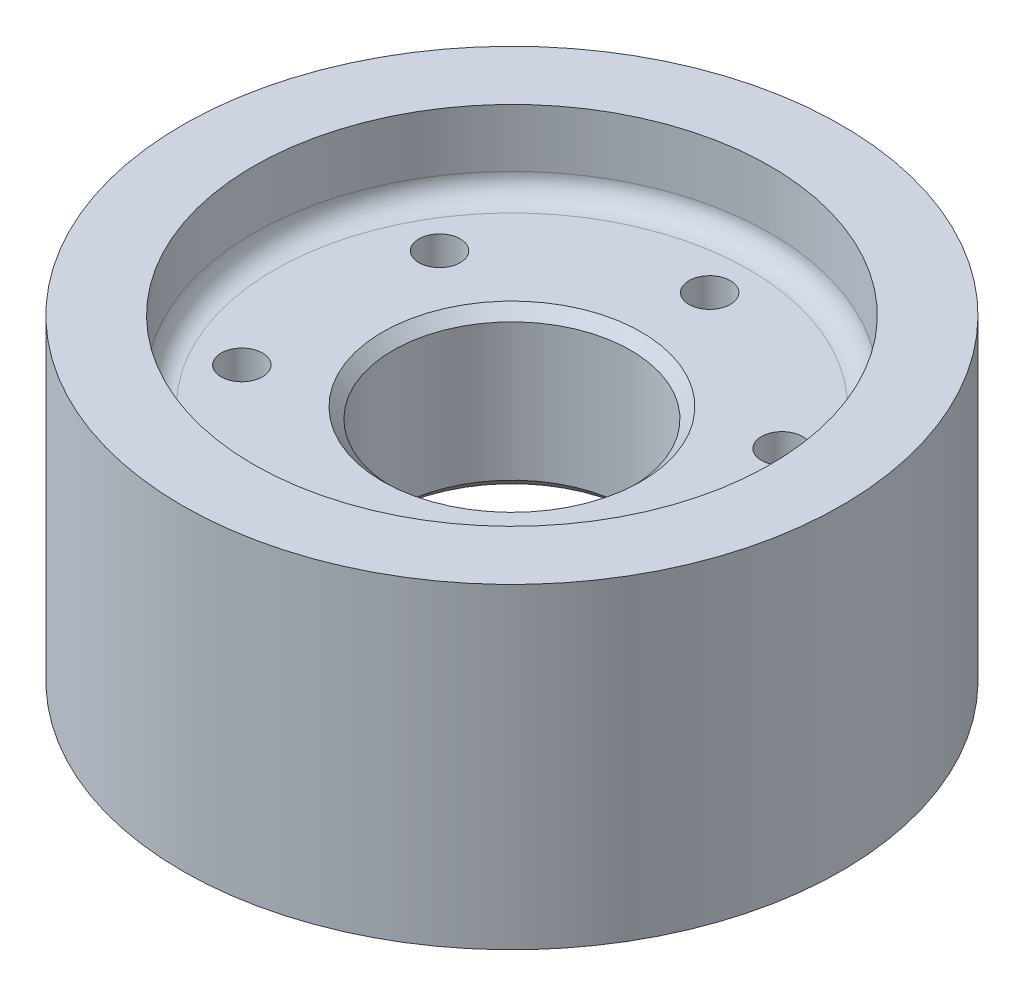
ISO-10303-21;
HEADER;
FILE_DESCRIPTION(('STEP AP214'),'2;1');
FILE_NAME('part.step','',(''),(''),'','','');
FILE_SCHEMA(('AUTOMOTIVE_DESIGN { 1 0 10303 214 1 1 1 1 }'));
ENDSEC;
DATA;
#1=APPLICATION_CONTEXT('core data for automotive mechanical design processes');
#2=APPLICATION_PROTOCOL_DEFINITION('international standard','automotive_design',2000,#1);
#3=PRODUCT_CONTEXT('',#1,'mechanical');
#4=PRODUCT('Part','Part','',(#3));
#5=PRODUCT_RELATED_PRODUCT_CATEGORY('part','',(#4));
#6=PRODUCT_DEFINITION_FORMATION('','',#4);
#7=PRODUCT_DEFINITION_CONTEXT('part definition',#1,'design');
#8=PRODUCT_DEFINITION('design','',#6,#7);
#9=PRODUCT_DEFINITION_SHAPE('','',#8);
#10=(LENGTH_UNIT() NAMED_UNIT(*) SI_UNIT(.MILLI.,.METRE.));
#11=(NAMED_UNIT(*) PLANE_ANGLE_UNIT() SI_UNIT($,.RADIAN.));
#12=(NAMED_UNIT(*) SI_UNIT($,.STERADIAN.) SOLID_ANGLE_UNIT());
#13=UNCERTAINTY_MEASURE_WITH_UNIT(LENGTH_MEASURE(1.E-05),#10,'distance_accuracy_value','');
#14=(GEOMETRIC_REPRESENTATION_CONTEXT(3) GLOBAL_UNCERTAINTY_ASSIGNED_CONTEXT((#13)) GLOBAL_UNIT_ASSIGNED_CONTEXT((#10,
#11,#12)) REPRESENTATION_CONTEXT('',''));
#15=CARTESIAN_POINT('',(0.,0.,0.));
#16=DIRECTION('',(0.,0.,1.));
#17=DIRECTION('',(1.,0.,0.));
#18=AXIS2_PLACEMENT_3D('',#15,#16,#17);
#19=CARTESIAN_POINT('',(0.,19.05,0.));
#20=DIRECTION('',(0.,-1.,0.));
#21=DIRECTION('',(0.,0.,-1.));
#22=AXIS2_PLACEMENT_3D('',#19,#20,#21);
#23=CYLINDRICAL_SURFACE('',#22,31.115);
#24=CARTESIAN_POINT('',(0.,-12.065,0.));
#25=DIRECTION('',(0.,1.,0.));
#26=DIRECTION('',(0.,0.,1.));
#27=AXIS2_PLACEMENT_3D('',#24,#25,#26);
#28=CIRCLE('',#27,31.115);
#29=CARTESIAN_POINT('',(0.,-12.065,31.115));
#30=VERTEX_POINT('',#29);
#31=EDGE_CURVE('E10',#30,#30,#28,.T.);
#32=ORIENTED_EDGE('',*,*,#31,.T.);
#33=EDGE_LOOP('',(#32));
#34=FACE_BOUND('',#33,.T.);
#35=CARTESIAN_POINT('',(0.,-19.05,0.));
#36=DIRECTION('',(0.,1.,0.));
#37=DIRECTION('',(0.,0.,1.));
#38=AXIS2_PLACEMENT_3D('',#35,#36,#37);
#39=CIRCLE('',#38,31.115);
#40=CARTESIAN_POINT('',(0.,-19.05,31.115));
#41=VERTEX_POINT('',#40);
#42=EDGE_CURVE('E83',#41,#41,#39,.T.);
#43=ORIENTED_EDGE('',*,*,#42,.F.);
#44=EDGE_LOOP('',(#43));
#45=FACE_BOUND('',#44,.T.);
#46=ADVANCED_FACE('F34',(#34,#45),#23,.F.);
#47=CARTESIAN_POINT('',(0.,19.05,0.));
#48=DIRECTION('',(0.,1.,0.));
#49=DIRECTION('',(0.,0.,1.));
#50=AXIS2_PLACEMENT_3D('',#47,#48,#49);
#51=PLANE('',#50);
#52=CARTESIAN_POINT('',(0.,19.05,0.));
#53=DIRECTION('',(0.,1.,0.));
#54=DIRECTION('',(0.,0.,1.));
#55=AXIS2_PLACEMENT_3D('',#52,#53,#54);
#56=CIRCLE('',#55,39.6875);
#57=CARTESIAN_POINT('',(0.,19.05,39.6875));
#58=VERTEX_POINT('',#57);
#59=EDGE_CURVE('E66',#58,#58,#56,.T.);
#60=ORIENTED_EDGE('',*,*,#59,.T.);
#61=EDGE_LOOP('',(#60));
#62=FACE_BOUND('',#61,.T.);
#63=CARTESIAN_POINT('',(0.,19.05,0.));
#64=DIRECTION('',(0.,1.,0.));
#65=DIRECTION('',(0.,0.,1.));
#66=AXIS2_PLACEMENT_3D('',#63,#64,#65);
#67=CIRCLE('',#66,31.115);
#68=CARTESIAN_POINT('',(0.,19.05,31.115));
#69=VERTEX_POINT('',#68);
#70=EDGE_CURVE('E80',#69,#69,#67,.T.);
#71=ORIENTED_EDGE('',*,*,#70,.F.);
#72=EDGE_LOOP('',(#71));
#73=FACE_BOUND('',#72,.T.);
#74=ADVANCED_FACE('F153',(#62,#73),#51,.T.);
#75=CARTESIAN_POINT('',(0.,-19.05,0.));
#76=DIRECTION('',(0.,1.,0.));
#77=DIRECTION('',(0.,0.,1.));
#78=AXIS2_PLACEMENT_3D('',#75,#76,#77);
#79=PLANE('',#78);
#80=CARTESIAN_POINT('',(0.,-19.05,0.));
#81=DIRECTION('',(0.,1.,0.));
#82=DIRECTION('',(0.,0.,1.));
#83=AXIS2_PLACEMENT_3D('',#80,#81,#82);
#84=CIRCLE('',#83,39.6875);
#85=CARTESIAN_POINT('',(0.,-19.05,39.6875));
#86=VERTEX_POINT('',#85);
#87=EDGE_CURVE('E77',#86,#86,#84,.T.);
#88=ORIENTED_EDGE('',*,*,#87,.F.);
#89=EDGE_LOOP('',(#88));
#90=FACE_BOUND('',#89,.T.);
#91=ORIENTED_EDGE('',*,*,#42,.T.);
#92=EDGE_LOOP('',(#91));
#93=FACE_BOUND('',#92,.T.);
#94=ADVANCED_FACE('F158',(#90,#93),#79,.F.);
#95=CARTESIAN_POINT('',(0.,19.05,0.));
#96=DIRECTION('',(0.,-1.,0.));
#97=DIRECTION('',(0.,0.,-1.));
#98=AXIS2_PLACEMENT_3D('',#95,#96,#97);
#99=CYLINDRICAL_SURFACE('',#98,39.6875);
#100=ORIENTED_EDGE('',*,*,#59,.F.);
#101=EDGE_LOOP('',(#100));
#102=FACE_BOUND('',#101,.T.);
#103=ORIENTED_EDGE('',*,*,#87,.T.);
#104=EDGE_LOOP('',(#103));
#105=FACE_BOUND('',#104,.T.);
#106=ADVANCED_FACE('F163',(#102,#105),#99,.T.);
#107=CARTESIAN_POINT('',(0.,12.065,0.));
#108=DIRECTION('',(0.,1.,0.));
#109=DIRECTION('',(0.,0.,1.));
#110=AXIS2_PLACEMENT_3D('',#107,#108,#109);
#111=CIRCLE('',#110,31.115);
#112=CARTESIAN_POINT('',(0.,12.065,31.115));
#113=VERTEX_POINT('',#112);
#114=EDGE_CURVE('E49',#113,#113,#111,.F.);
#115=ORIENTED_EDGE('',*,*,#114,.T.);
#116=EDGE_LOOP('',(#115));
#117=FACE_BOUND('',#116,.T.);
#118=ORIENTED_EDGE('',*,*,#70,.T.);
#119=EDGE_LOOP('',(#118));
#120=FACE_BOUND('',#119,.T.);
#121=ADVANCED_FACE('F122',(#117,#120),#23,.F.);
#122=CARTESIAN_POINT('',(0.,9.525,0.));
#123=DIRECTION('',(0.,1.,0.));
#124=DIRECTION('',(0.,0.,1.));
#125=AXIS2_PLACEMENT_3D('',#122,#123,#124);
#126=PLANE('',#125);
#127=CARTESIAN_POINT('',(0.,9.525,0.));
#128=DIRECTION('',(0.,1.,0.));
#129=DIRECTION('',(0.,0.,1.));
#130=AXIS2_PLACEMENT_3D('',#127,#128,#129);
#131=CIRCLE('',#130,28.575);
#132=CARTESIAN_POINT('',(0.,9.525,28.575));
#133=VERTEX_POINT('',#132);
#134=EDGE_CURVE('E45',#133,#133,#131,.T.);
#135=ORIENTED_EDGE('',*,*,#134,.T.);
#136=EDGE_LOOP('',(#135));
#137=FACE_BOUND('',#136,.T.);
#138=CARTESIAN_POINT('',(0.,9.525,0.));
#139=DIRECTION('',(0.,1.,0.));
#140=DIRECTION('',(0.,0.,1.));
#141=AXIS2_PLACEMENT_3D('',#138,#139,#140);
#142=CIRCLE('',#141,15.5829000000001);
#143=CARTESIAN_POINT('',(0.,9.525,15.5829000000001));
#144=VERTEX_POINT('',#143);
#145=EDGE_CURVE('E57',#144,#144,#142,.F.);
#146=ORIENTED_EDGE('',*,*,#145,.T.);
#147=EDGE_LOOP('',(#146));
#148=FACE_BOUND('',#147,.T.);
#149=CARTESIAN_POINT('',(20.6222299276168,9.525,-11.9062500000002));
#150=DIRECTION('',(0.,1.,0.));
#151=DIRECTION('',(0.,0.,1.));
#152=AXIS2_PLACEMENT_3D('',#149,#150,#151);
#153=CIRCLE('',#152,2.4892);
#154=CARTESIAN_POINT('',(20.6222299276168,9.525,-9.41705000000024));
#155=VERTEX_POINT('',#154);
#156=EDGE_CURVE('E71',#155,#155,#153,.T.);
#157=ORIENTED_EDGE('',*,*,#156,.F.);
#158=EDGE_LOOP('',(#157));
#159=FACE_BOUND('',#158,.T.);
#160=CARTESIAN_POINT('',(20.6222299276171,9.525,11.9062499999998));
#161=DIRECTION('',(0.,1.,0.));
#162=DIRECTION('',(0.,0.,1.));
#163=AXIS2_PLACEMENT_3D('',#160,#161,#162);
#164=CIRCLE('',#163,2.4892);
#165=CARTESIAN_POINT('',(20.6222299276171,9.525,14.3954499999998));
#166=VERTEX_POINT('',#165);
#167=EDGE_CURVE('E70',#166,#166,#164,.T.);
#168=ORIENTED_EDGE('',*,*,#167,.F.);
#169=EDGE_LOOP('',(#168));
#170=FACE_BOUND('',#169,.T.);
#171=CARTESIAN_POINT('',(0.,9.525,23.8125));
#172=DIRECTION('',(0.,1.,0.));
#173=DIRECTION('',(0.,0.,1.));
#174=AXIS2_PLACEMENT_3D('',#171,#172,#173);
#175=CIRCLE('',#174,2.4892);
#176=CARTESIAN_POINT('',(0.,9.525,26.3017));
#177=VERTEX_POINT('',#176);
#178=EDGE_CURVE('E104',#177,#177,#175,.T.);
#179=ORIENTED_EDGE('',*,*,#178,.F.);
#180=EDGE_LOOP('',(#179));
#181=FACE_BOUND('',#180,.T.);
#182=CARTESIAN_POINT('',(-20.6222299276169,9.525,11.9062500000001));
#183=DIRECTION('',(0.,1.,0.));
#184=DIRECTION('',(0.,0.,1.));
#185=AXIS2_PLACEMENT_3D('',#182,#183,#184);
#186=CIRCLE('',#185,2.4892);
#187=CARTESIAN_POINT('',(-20.6222299276169,9.525,14.3954500000001));
#188=VERTEX_POINT('',#187);
#189=EDGE_CURVE('E98',#188,#188,#186,.T.);
#190=ORIENTED_EDGE('',*,*,#189,.F.);
#191=EDGE_LOOP('',(#190));
#192=FACE_BOUND('',#191,.T.);
#193=CARTESIAN_POINT('',(-20.622229927617,9.525,-11.90625));
#194=DIRECTION('',(0.,1.,0.));
#195=DIRECTION('',(0.,0.,1.));
#196=AXIS2_PLACEMENT_3D('',#193,#194,#195);
#197=CIRCLE('',#196,2.4892);
#198=CARTESIAN_POINT('',(-20.622229927617,9.525,-9.41704999999996));
#199=VERTEX_POINT('',#198);
#200=EDGE_CURVE('E76',#199,#199,#197,.T.);
#201=ORIENTED_EDGE('',*,*,#200,.F.);
#202=EDGE_LOOP('',(#201));
#203=FACE_BOUND('',#202,.T.);
#204=CARTESIAN_POINT('',(0.,9.525,-23.8125));
#205=DIRECTION('',(0.,1.,0.));
#206=DIRECTION('',(0.,0.,1.));
#207=AXIS2_PLACEMENT_3D('',#204,#205,#206);
#208=CIRCLE('',#207,2.4892);
#209=CARTESIAN_POINT('',(0.,9.525,-21.3233));
#210=VERTEX_POINT('',#209);
#211=EDGE_CURVE('E75',#210,#210,#208,.T.);
#212=ORIENTED_EDGE('',*,*,#211,.F.);
#213=EDGE_LOOP('',(#212));
#214=FACE_BOUND('',#213,.T.);
#215=ADVANCED_FACE('F118',(#137,#148,#159,#170,#181,#192,#203,#214),#126,.T.);
#216=CARTESIAN_POINT('',(0.,-9.525,0.));
#217=DIRECTION('',(0.,1.,0.));
#218=DIRECTION('',(0.,0.,1.));
#219=AXIS2_PLACEMENT_3D('',#216,#217,#218);
#220=PLANE('',#219);
#221=CARTESIAN_POINT('',(0.,-9.525,0.));
#222=DIRECTION('',(0.,1.,0.));
#223=DIRECTION('',(0.,0.,1.));
#224=AXIS2_PLACEMENT_3D('',#221,#222,#223);
#225=CIRCLE('',#224,28.575);
#226=CARTESIAN_POINT('',(0.,-9.525,28.575));
#227=VERTEX_POINT('',#226);
#228=EDGE_CURVE('E41',#227,#227,#225,.F.);
#229=ORIENTED_EDGE('',*,*,#228,.T.);
#230=EDGE_LOOP('',(#229));
#231=FACE_BOUND('',#230,.T.);
#232=CARTESIAN_POINT('',(0.,-9.525,0.));
#233=DIRECTION('',(0.,1.,0.));
#234=DIRECTION('',(0.,0.,1.));
#235=AXIS2_PLACEMENT_3D('',#232,#233,#234);
#236=CIRCLE('',#235,15.5829);
#237=CARTESIAN_POINT('',(0.,-9.525,15.5829));
#238=VERTEX_POINT('',#237);
#239=EDGE_CURVE('E54',#238,#238,#236,.T.);
#240=ORIENTED_EDGE('',*,*,#239,.T.);
#241=EDGE_LOOP('',(#240));
#242=FACE_BOUND('',#241,.T.);
#243=CARTESIAN_POINT('',(20.6222299276168,-9.525,-11.9062500000002));
#244=DIRECTION('',(0.,1.,0.));
#245=DIRECTION('',(0.,0.,1.));
#246=AXIS2_PLACEMENT_3D('',#243,#244,#245);
#247=CIRCLE('',#246,2.4892);
#248=CARTESIAN_POINT('',(20.6222299276168,-9.525,-9.41705000000025));
#249=VERTEX_POINT('',#248);
#250=EDGE_CURVE('E67',#249,#249,#247,.T.);
#251=ORIENTED_EDGE('',*,*,#250,.T.);
#252=EDGE_LOOP('',(#251));
#253=FACE_BOUND('',#252,.T.);
#254=CARTESIAN_POINT('',(20.6222299276171,-9.525,11.9062499999998));
#255=DIRECTION('',(0.,1.,0.));
#256=DIRECTION('',(0.,0.,1.));
#257=AXIS2_PLACEMENT_3D('',#254,#255,#256);
#258=CIRCLE('',#257,2.4892);
#259=CARTESIAN_POINT('',(20.6222299276171,-9.525,14.3954499999998));
#260=VERTEX_POINT('',#259);
#261=EDGE_CURVE('E107',#260,#260,#258,.T.);
#262=ORIENTED_EDGE('',*,*,#261,.T.);
#263=EDGE_LOOP('',(#262));
#264=FACE_BOUND('',#263,.T.);
#265=CARTESIAN_POINT('',(0.,-9.525,23.8125));
#266=DIRECTION('',(0.,1.,0.));
#267=DIRECTION('',(0.,0.,1.));
#268=AXIS2_PLACEMENT_3D('',#265,#266,#267);
#269=CIRCLE('',#268,2.4892);
#270=CARTESIAN_POINT('',(0.,-9.525,26.3017));
#271=VERTEX_POINT('',#270);
#272=EDGE_CURVE('E101',#271,#271,#269,.T.);
#273=ORIENTED_EDGE('',*,*,#272,.T.);
#274=EDGE_LOOP('',(#273));
#275=FACE_BOUND('',#274,.T.);
#276=CARTESIAN_POINT('',(-20.6222299276169,-9.525,11.9062500000001));
#277=DIRECTION('',(0.,1.,0.));
#278=DIRECTION('',(0.,0.,1.));
#279=AXIS2_PLACEMENT_3D('',#276,#277,#278);
#280=CIRCLE('',#279,2.4892);
#281=CARTESIAN_POINT('',(-20.6222299276169,-9.525,14.3954500000001));
#282=VERTEX_POINT('',#281);
#283=EDGE_CURVE('E95',#282,#282,#280,.T.);
#284=ORIENTED_EDGE('',*,*,#283,.T.);
#285=EDGE_LOOP('',(#284));
#286=FACE_BOUND('',#285,.T.);
#287=CARTESIAN_POINT('',(-20.622229927617,-9.525,-11.90625));
#288=DIRECTION('',(0.,1.,0.));
#289=DIRECTION('',(0.,0.,1.));
#290=AXIS2_PLACEMENT_3D('',#287,#288,#289);
#291=CIRCLE('',#290,2.4892);
#292=CARTESIAN_POINT('',(-20.622229927617,-9.525,-9.41704999999996));
#293=VERTEX_POINT('',#292);
#294=EDGE_CURVE('E72',#293,#293,#291,.T.);
#295=ORIENTED_EDGE('',*,*,#294,.T.);
#296=EDGE_LOOP('',(#295));
#297=FACE_BOUND('',#296,.T.);
#298=CARTESIAN_POINT('',(0.,-9.525,-23.8125));
#299=DIRECTION('',(0.,1.,0.));
#300=DIRECTION('',(0.,0.,1.));
#301=AXIS2_PLACEMENT_3D('',#298,#299,#300);
#302=CIRCLE('',#301,2.4892);
#303=CARTESIAN_POINT('',(0.,-9.525,-21.3233));
#304=VERTEX_POINT('',#303);
#305=EDGE_CURVE('E86',#304,#304,#302,.T.);
#306=ORIENTED_EDGE('',*,*,#305,.T.);
#307=EDGE_LOOP('',(#306));
#308=FACE_BOUND('',#307,.T.);
#309=ADVANCED_FACE('F121',(#231,#242,#253,#264,#275,#286,#297,#308),#220,.F.);
#310=CARTESIAN_POINT('',(0.,9.525,0.));
#311=DIRECTION('',(0.,-1.,0.));
#312=DIRECTION('',(0.,0.,-1.));
#313=AXIS2_PLACEMENT_3D('',#310,#311,#312);
#314=CYLINDRICAL_SURFACE('',#313,14.3129);
#315=CARTESIAN_POINT('',(0.,8.25499999999992,0.));
#316=DIRECTION('',(0.,1.,0.));
#317=DIRECTION('',(0.,0.,1.));
#318=AXIS2_PLACEMENT_3D('',#315,#316,#317);
#319=CIRCLE('',#318,14.3129);
#320=CARTESIAN_POINT('',(0.,8.25499999999992,14.3129));
#321=VERTEX_POINT('',#320);
#322=EDGE_CURVE('E60',#321,#321,#319,.T.);
#323=ORIENTED_EDGE('',*,*,#322,.T.);
#324=EDGE_LOOP('',(#323));
#325=FACE_BOUND('',#324,.T.);
#326=CARTESIAN_POINT('',(0.,-8.25500000000005,0.));
#327=DIRECTION('',(0.,1.,0.));
#328=DIRECTION('',(0.,0.,1.));
#329=AXIS2_PLACEMENT_3D('',#326,#327,#328);
#330=CIRCLE('',#329,14.3129);
#331=CARTESIAN_POINT('',(0.,-8.25500000000005,14.3129));
#332=VERTEX_POINT('',#331);
#333=EDGE_CURVE('E63',#332,#332,#330,.F.);
#334=ORIENTED_EDGE('',*,*,#333,.T.);
#335=EDGE_LOOP('',(#334));
#336=FACE_BOUND('',#335,.T.);
#337=ADVANCED_FACE('F139',(#325,#336),#314,.F.);
#338=CARTESIAN_POINT('',(0.,9.525,-23.8125));
#339=DIRECTION('',(0.,1.,0.));
#340=DIRECTION('',(0.,0.,1.));
#341=AXIS2_PLACEMENT_3D('',#338,#339,#340);
#342=CYLINDRICAL_SURFACE('',#341,2.4892);
#343=ORIENTED_EDGE('',*,*,#211,.T.);
#344=EDGE_LOOP('',(#343));
#345=FACE_BOUND('',#344,.T.);
#346=ORIENTED_EDGE('',*,*,#305,.F.);
#347=EDGE_LOOP('',(#346));
#348=FACE_BOUND('',#347,.T.);
#349=ADVANCED_FACE('F135',(#345,#348),#342,.F.);
#350=CARTESIAN_POINT('',(-20.622229927617,9.525,-11.90625));
#351=DIRECTION('',(0.,1.,0.));
#352=DIRECTION('',(0.,0.,1.));
#353=AXIS2_PLACEMENT_3D('',#350,#351,#352);
#354=CYLINDRICAL_SURFACE('',#353,2.4892);
#355=ORIENTED_EDGE('',*,*,#200,.T.);
#356=EDGE_LOOP('',(#355));
#357=FACE_BOUND('',#356,.T.);
#358=ORIENTED_EDGE('',*,*,#294,.F.);
#359=EDGE_LOOP('',(#358));
#360=FACE_BOUND('',#359,.T.);
#361=ADVANCED_FACE('F138',(#357,#360),#354,.F.);
#362=CARTESIAN_POINT('',(-20.6222299276169,9.525,11.9062500000001));
#363=DIRECTION('',(0.,1.,0.));
#364=DIRECTION('',(0.,0.,1.));
#365=AXIS2_PLACEMENT_3D('',#362,#363,#364);
#366=CYLINDRICAL_SURFACE('',#365,2.4892);
#367=ORIENTED_EDGE('',*,*,#189,.T.);
#368=EDGE_LOOP('',(#367));
#369=FACE_BOUND('',#368,.T.);
#370=ORIENTED_EDGE('',*,*,#283,.F.);
#371=EDGE_LOOP('',(#370));
#372=FACE_BOUND('',#371,.T.);
#373=ADVANCED_FACE('F214',(#369,#372),#366,.F.);
#374=CARTESIAN_POINT('',(0.,9.525,23.8125));
#375=DIRECTION('',(0.,1.,0.));
#376=DIRECTION('',(0.,0.,1.));
#377=AXIS2_PLACEMENT_3D('',#374,#375,#376);
#378=CYLINDRICAL_SURFACE('',#377,2.4892);
#379=ORIENTED_EDGE('',*,*,#178,.T.);
#380=EDGE_LOOP('',(#379));
#381=FACE_BOUND('',#380,.T.);
#382=ORIENTED_EDGE('',*,*,#272,.F.);
#383=EDGE_LOOP('',(#382));
#384=FACE_BOUND('',#383,.T.);
#385=ADVANCED_FACE('F220',(#381,#384),#378,.F.);
#386=CARTESIAN_POINT('',(20.6222299276171,9.525,11.9062499999998));
#387=DIRECTION('',(0.,1.,0.));
#388=DIRECTION('',(0.,0.,1.));
#389=AXIS2_PLACEMENT_3D('',#386,#387,#388);
#390=CYLINDRICAL_SURFACE('',#389,2.4892);
#391=ORIENTED_EDGE('',*,*,#167,.T.);
#392=EDGE_LOOP('',(#391));
#393=FACE_BOUND('',#392,.T.);
#394=ORIENTED_EDGE('',*,*,#261,.F.);
#395=EDGE_LOOP('',(#394));
#396=FACE_BOUND('',#395,.T.);
#397=ADVANCED_FACE('F193',(#393,#396),#390,.F.);
#398=CARTESIAN_POINT('',(20.6222299276168,9.525,-11.9062500000002));
#399=DIRECTION('',(0.,1.,0.));
#400=DIRECTION('',(0.,0.,1.));
#401=AXIS2_PLACEMENT_3D('',#398,#399,#400);
#402=CYLINDRICAL_SURFACE('',#401,2.4892);
#403=ORIENTED_EDGE('',*,*,#156,.T.);
#404=EDGE_LOOP('',(#403));
#405=FACE_BOUND('',#404,.T.);
#406=ORIENTED_EDGE('',*,*,#250,.F.);
#407=EDGE_LOOP('',(#406));
#408=FACE_BOUND('',#407,.T.);
#409=ADVANCED_FACE('F115',(#405,#408),#402,.F.);
#410=CARTESIAN_POINT('',(0.,8.25499999999992,0.));
#411=DIRECTION('',(0.,1.,0.));
#412=DIRECTION('',(0.,0.,1.));
#413=AXIS2_PLACEMENT_3D('',#410,#411,#412);
#414=CONICAL_SURFACE('',#413,14.3129,0.785398163397449);
#415=ORIENTED_EDGE('',*,*,#145,.F.);
#416=EDGE_LOOP('',(#415));
#417=FACE_BOUND('',#416,.T.);
#418=ORIENTED_EDGE('',*,*,#322,.F.);
#419=EDGE_LOOP('',(#418));
#420=FACE_BOUND('',#419,.T.);
#421=ADVANCED_FACE('F184',(#417,#420),#414,.F.);
#422=CARTESIAN_POINT('',(0.,-9.525,0.));
#423=DIRECTION('',(0.,-1.,0.));
#424=DIRECTION('',(0.,0.,-1.));
#425=AXIS2_PLACEMENT_3D('',#422,#423,#424);
#426=CONICAL_SURFACE('',#425,15.5829,0.785398163397448);
#427=ORIENTED_EDGE('',*,*,#333,.F.);
#428=EDGE_LOOP('',(#427));
#429=FACE_BOUND('',#428,.T.);
#430=ORIENTED_EDGE('',*,*,#239,.F.);
#431=EDGE_LOOP('',(#430));
#432=FACE_BOUND('',#431,.T.);
#433=ADVANCED_FACE('F177',(#429,#432),#426,.F.);
#434=CARTESIAN_POINT('',(0.,12.065,0.));
#435=DIRECTION('',(0.,1.,0.));
#436=DIRECTION('',(0.,0.,1.));
#437=AXIS2_PLACEMENT_3D('',#434,#435,#436);
#438=TOROIDAL_SURFACE('',#437,28.575,2.54);
#439=ORIENTED_EDGE('',*,*,#134,.F.);
#440=EDGE_LOOP('',(#439));
#441=FACE_BOUND('',#440,.T.);
#442=ORIENTED_EDGE('',*,*,#114,.F.);
#443=EDGE_LOOP('',(#442));
#444=FACE_BOUND('',#443,.T.);
#445=ADVANCED_FACE('F175',(#441,#444),#438,.F.);
#446=CARTESIAN_POINT('',(0.,-12.065,0.));
#447=DIRECTION('',(0.,1.,0.));
#448=DIRECTION('',(0.,0.,1.));
#449=AXIS2_PLACEMENT_3D('',#446,#447,#448);
#450=TOROIDAL_SURFACE('',#449,28.575,2.54);
#451=ORIENTED_EDGE('',*,*,#31,.F.);
#452=EDGE_LOOP('',(#451));
#453=FACE_BOUND('',#452,.T.);
#454=ORIENTED_EDGE('',*,*,#228,.F.);
#455=EDGE_LOOP('',(#454));
#456=FACE_BOUND('',#455,.T.);
#457=ADVANCED_FACE('F36',(#453,#456),#450,.F.);
#458=CLOSED_SHELL('',(#46,#74,#94,#106,#121,#215,#309,#337,#349,#361,#373,#385,#397,#409,#421,
#433,#445,#457));
#459=MANIFOLD_SOLID_BREP('B2',#458);
#460=ADVANCED_BREP_SHAPE_REPRESENTATION('',(#18,#459),#14);
#461=SHAPE_DEFINITION_REPRESENTATION(#9,#460);
ENDSEC;
END-ISO-10303-21;
